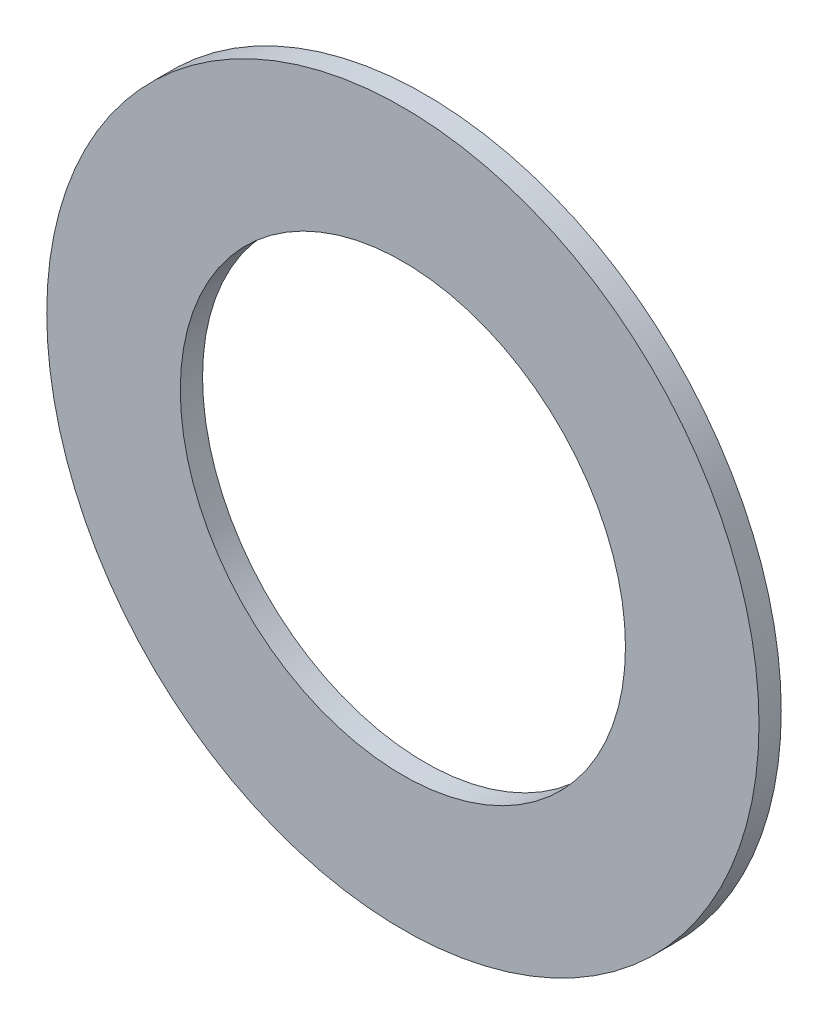
ISO-10303-21;
HEADER;
FILE_DESCRIPTION(('STEP AP214'),'2;1');
FILE_NAME('part.step','',(''),(''),'','','');
FILE_SCHEMA(('AUTOMOTIVE_DESIGN { 1 0 10303 214 1 1 1 1 }'));
ENDSEC;
DATA;
#1=APPLICATION_CONTEXT('core data for automotive mechanical design processes');
#2=APPLICATION_PROTOCOL_DEFINITION('international standard','automotive_design',2000,#1);
#3=PRODUCT_CONTEXT('',#1,'mechanical');
#4=PRODUCT('Part','Part','',(#3));
#5=PRODUCT_RELATED_PRODUCT_CATEGORY('part','',(#4));
#6=PRODUCT_DEFINITION_FORMATION('','',#4);
#7=PRODUCT_DEFINITION_CONTEXT('part definition',#1,'design');
#8=PRODUCT_DEFINITION('design','',#6,#7);
#9=PRODUCT_DEFINITION_SHAPE('','',#8);
#10=(LENGTH_UNIT() NAMED_UNIT(*) SI_UNIT(.MILLI.,.METRE.));
#11=(NAMED_UNIT(*) PLANE_ANGLE_UNIT() SI_UNIT($,.RADIAN.));
#12=(NAMED_UNIT(*) SI_UNIT($,.STERADIAN.) SOLID_ANGLE_UNIT());
#13=UNCERTAINTY_MEASURE_WITH_UNIT(LENGTH_MEASURE(1.E-05),#10,'distance_accuracy_value','');
#14=(GEOMETRIC_REPRESENTATION_CONTEXT(3) GLOBAL_UNCERTAINTY_ASSIGNED_CONTEXT((#13)) GLOBAL_UNIT_ASSIGNED_CONTEXT((#10,
#11,#12)) REPRESENTATION_CONTEXT('',''));
#15=CARTESIAN_POINT('',(0.,0.,0.));
#16=DIRECTION('',(0.,0.,1.));
#17=DIRECTION('',(1.,0.,0.));
#18=AXIS2_PLACEMENT_3D('',#15,#16,#17);
#19=CARTESIAN_POINT('',(0.,0.,0.5));
#20=DIRECTION('',(0.,0.,1.));
#21=DIRECTION('',(1.,0.,0.));
#22=AXIS2_PLACEMENT_3D('',#19,#20,#21);
#23=PLANE('',#22);
#24=CARTESIAN_POINT('',(0.,0.,0.5));
#25=DIRECTION('',(0.,0.,1.));
#26=DIRECTION('',(1.,0.,0.));
#27=AXIS2_PLACEMENT_3D('',#24,#25,#26);
#28=CIRCLE('',#27,8.);
#29=CARTESIAN_POINT('',(8.,0.,0.5));
#30=VERTEX_POINT('',#29);
#31=EDGE_CURVE('E10',#30,#30,#28,.T.);
#32=ORIENTED_EDGE('',*,*,#31,.T.);
#33=EDGE_LOOP('',(#32));
#34=FACE_BOUND('',#33,.T.);
#35=CARTESIAN_POINT('',(0.,0.,0.5));
#36=DIRECTION('',(0.,0.,1.));
#37=DIRECTION('',(1.,0.,0.));
#38=AXIS2_PLACEMENT_3D('',#35,#36,#37);
#39=CIRCLE('',#38,5.);
#40=CARTESIAN_POINT('',(5.,0.,0.5));
#41=VERTEX_POINT('',#40);
#42=EDGE_CURVE('E42',#41,#41,#39,.T.);
#43=ORIENTED_EDGE('',*,*,#42,.F.);
#44=EDGE_LOOP('',(#43));
#45=FACE_BOUND('',#44,.T.);
#46=ADVANCED_FACE('F31',(#34,#45),#23,.T.);
#47=CARTESIAN_POINT('',(0.,0.,0.));
#48=DIRECTION('',(0.,0.,1.));
#49=DIRECTION('',(1.,0.,0.));
#50=AXIS2_PLACEMENT_3D('',#47,#48,#49);
#51=PLANE('',#50);
#52=CARTESIAN_POINT('',(0.,0.,0.));
#53=DIRECTION('',(0.,0.,1.));
#54=DIRECTION('',(1.,0.,0.));
#55=AXIS2_PLACEMENT_3D('',#52,#53,#54);
#56=CIRCLE('',#55,8.);
#57=CARTESIAN_POINT('',(8.,0.,0.));
#58=VERTEX_POINT('',#57);
#59=EDGE_CURVE('E35',#58,#58,#56,.T.);
#60=ORIENTED_EDGE('',*,*,#59,.F.);
#61=EDGE_LOOP('',(#60));
#62=FACE_BOUND('',#61,.T.);
#63=CARTESIAN_POINT('',(0.,0.,0.));
#64=DIRECTION('',(0.,0.,1.));
#65=DIRECTION('',(1.,0.,0.));
#66=AXIS2_PLACEMENT_3D('',#63,#64,#65);
#67=CIRCLE('',#66,5.);
#68=CARTESIAN_POINT('',(5.,0.,0.));
#69=VERTEX_POINT('',#68);
#70=EDGE_CURVE('E44',#69,#69,#67,.T.);
#71=ORIENTED_EDGE('',*,*,#70,.T.);
#72=EDGE_LOOP('',(#71));
#73=FACE_BOUND('',#72,.T.);
#74=ADVANCED_FACE('F54',(#62,#73),#51,.F.);
#75=CARTESIAN_POINT('',(0.,0.,0.5));
#76=DIRECTION('',(0.,0.,-1.));
#77=DIRECTION('',(-1.,0.,0.));
#78=AXIS2_PLACEMENT_3D('',#75,#76,#77);
#79=CYLINDRICAL_SURFACE('',#78,8.);
#80=ORIENTED_EDGE('',*,*,#31,.F.);
#81=EDGE_LOOP('',(#80));
#82=FACE_BOUND('',#81,.T.);
#83=ORIENTED_EDGE('',*,*,#59,.T.);
#84=EDGE_LOOP('',(#83));
#85=FACE_BOUND('',#84,.T.);
#86=ADVANCED_FACE('F33',(#82,#85),#79,.T.);
#87=CARTESIAN_POINT('',(0.,0.,0.5));
#88=DIRECTION('',(0.,0.,-1.));
#89=DIRECTION('',(-1.,0.,0.));
#90=AXIS2_PLACEMENT_3D('',#87,#88,#89);
#91=CYLINDRICAL_SURFACE('',#90,5.);
#92=ORIENTED_EDGE('',*,*,#42,.T.);
#93=EDGE_LOOP('',(#92));
#94=FACE_BOUND('',#93,.T.);
#95=ORIENTED_EDGE('',*,*,#70,.F.);
#96=EDGE_LOOP('',(#95));
#97=FACE_BOUND('',#96,.T.);
#98=ADVANCED_FACE('F50',(#94,#97),#91,.F.);
#99=CLOSED_SHELL('',(#46,#74,#86,#98));
#100=MANIFOLD_SOLID_BREP('B2',#99);
#101=ADVANCED_BREP_SHAPE_REPRESENTATION('',(#18,#100),#14);
#102=SHAPE_DEFINITION_REPRESENTATION(#9,#101);
ENDSEC;
END-ISO-10303-21;
